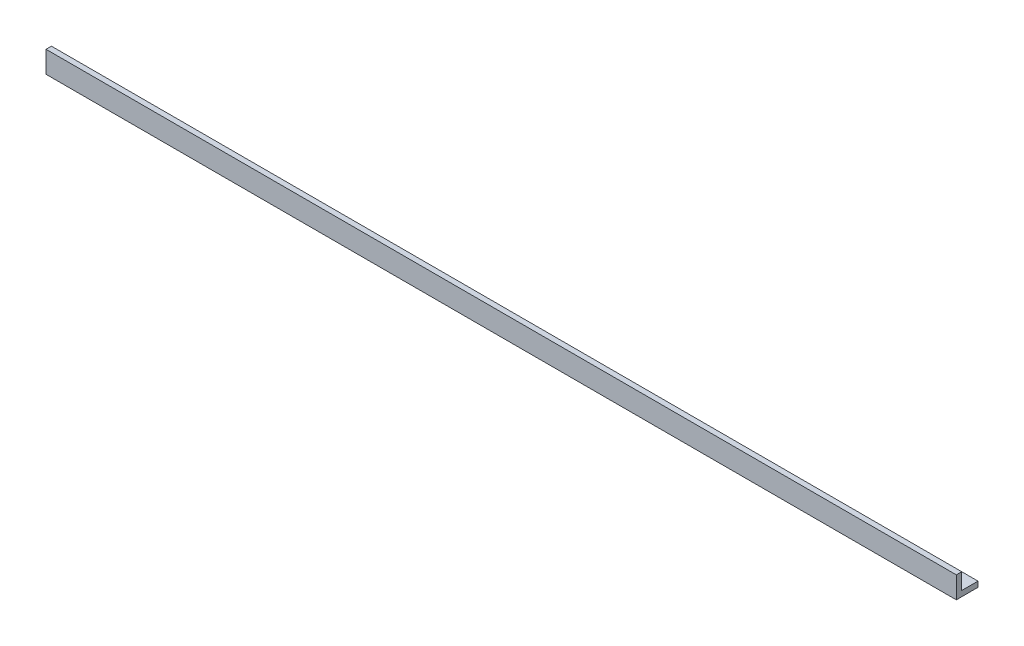
ISO-10303-21;
HEADER;
FILE_DESCRIPTION(('STEP AP214'),'2;1');
FILE_NAME('part.step','',(''),(''),'','','');
FILE_SCHEMA(('AUTOMOTIVE_DESIGN { 1 0 10303 214 1 1 1 1 }'));
ENDSEC;
DATA;
#1=APPLICATION_CONTEXT('core data for automotive mechanical design processes');
#2=APPLICATION_PROTOCOL_DEFINITION('international standard','automotive_design',2000,#1);
#3=PRODUCT_CONTEXT('',#1,'mechanical');
#4=PRODUCT('Part','Part','',(#3));
#5=PRODUCT_RELATED_PRODUCT_CATEGORY('part','',(#4));
#6=PRODUCT_DEFINITION_FORMATION('','',#4);
#7=PRODUCT_DEFINITION_CONTEXT('part definition',#1,'design');
#8=PRODUCT_DEFINITION('design','',#6,#7);
#9=PRODUCT_DEFINITION_SHAPE('','',#8);
#10=(LENGTH_UNIT() NAMED_UNIT(*) SI_UNIT(.MILLI.,.METRE.));
#11=(NAMED_UNIT(*) PLANE_ANGLE_UNIT() SI_UNIT($,.RADIAN.));
#12=(NAMED_UNIT(*) SI_UNIT($,.STERADIAN.) SOLID_ANGLE_UNIT());
#13=UNCERTAINTY_MEASURE_WITH_UNIT(LENGTH_MEASURE(1.E-05),#10,'distance_accuracy_value','');
#14=(GEOMETRIC_REPRESENTATION_CONTEXT(3) GLOBAL_UNCERTAINTY_ASSIGNED_CONTEXT((#13)) GLOBAL_UNIT_ASSIGNED_CONTEXT((#10,
#11,#12)) REPRESENTATION_CONTEXT('',''));
#15=CARTESIAN_POINT('',(0.,0.,0.));
#16=DIRECTION('',(0.,0.,1.));
#17=DIRECTION('',(1.,0.,0.));
#18=AXIS2_PLACEMENT_3D('',#15,#16,#17);
#19=CARTESIAN_POINT('',(-533.4,0.,-25.4));
#20=DIRECTION('',(0.,0.,1.));
#21=DIRECTION('',(1.,0.,0.));
#22=AXIS2_PLACEMENT_3D('',#19,#20,#21);
#23=PLANE('',#22);
#24=DIRECTION('',(1.,0.,0.));
#25=VECTOR('',#24,1.);
#26=CARTESIAN_POINT('',(-533.4,6.35,-25.4));
#27=LINE('',#26,#25);
#28=CARTESIAN_POINT('',(-533.4,6.35,-25.4));
#29=VERTEX_POINT('',#28);
#30=CARTESIAN_POINT('',(533.4,6.35,-25.4));
#31=VERTEX_POINT('',#30);
#32=EDGE_CURVE('E39',#29,#31,#27,.T.);
#33=ORIENTED_EDGE('',*,*,#32,.T.);
#34=DIRECTION('',(0.,-1.,0.));
#35=VECTOR('',#34,1.);
#36=CARTESIAN_POINT('',(533.4,0.,-25.4));
#37=LINE('',#36,#35);
#38=CARTESIAN_POINT('',(533.4,0.,-25.4));
#39=VERTEX_POINT('',#38);
#40=EDGE_CURVE('E91',#31,#39,#37,.T.);
#41=ORIENTED_EDGE('',*,*,#40,.T.);
#42=DIRECTION('',(1.,0.,0.));
#43=VECTOR('',#42,1.);
#44=CARTESIAN_POINT('',(-533.4,0.,-25.4));
#45=LINE('',#44,#43);
#46=CARTESIAN_POINT('',(-533.4,0.,-25.4));
#47=VERTEX_POINT('',#46);
#48=EDGE_CURVE('E11',#47,#39,#45,.T.);
#49=ORIENTED_EDGE('',*,*,#48,.F.);
#50=DIRECTION('',(0.,-1.,0.));
#51=VECTOR('',#50,1.);
#52=CARTESIAN_POINT('',(-533.4,0.,-25.4));
#53=LINE('',#52,#51);
#54=EDGE_CURVE('E52',#29,#47,#53,.T.);
#55=ORIENTED_EDGE('',*,*,#54,.F.);
#56=EDGE_LOOP('',(#33,#41,#49,#55));
#57=FACE_BOUND('',#56,.T.);
#58=ADVANCED_FACE('F36',(#57),#23,.F.);
#59=CARTESIAN_POINT('',(-533.4,0.,0.));
#60=DIRECTION('',(0.,-1.,0.));
#61=DIRECTION('',(0.,0.,-1.));
#62=AXIS2_PLACEMENT_3D('',#59,#60,#61);
#63=PLANE('',#62);
#64=ORIENTED_EDGE('',*,*,#48,.T.);
#65=DIRECTION('',(0.,0.,-1.));
#66=VECTOR('',#65,1.);
#67=CARTESIAN_POINT('',(533.4,0.,0.));
#68=LINE('',#67,#66);
#69=CARTESIAN_POINT('',(533.4,0.,0.));
#70=VERTEX_POINT('',#69);
#71=EDGE_CURVE('E105',#70,#39,#68,.T.);
#72=ORIENTED_EDGE('',*,*,#71,.F.);
#73=DIRECTION('',(1.,0.,0.));
#74=VECTOR('',#73,1.);
#75=CARTESIAN_POINT('',(-533.4,0.,0.));
#76=LINE('',#75,#74);
#77=CARTESIAN_POINT('',(-533.4,0.,0.));
#78=VERTEX_POINT('',#77);
#79=EDGE_CURVE('E44',#78,#70,#76,.T.);
#80=ORIENTED_EDGE('',*,*,#79,.F.);
#81=DIRECTION('',(0.,0.,-1.));
#82=VECTOR('',#81,1.);
#83=CARTESIAN_POINT('',(-533.4,0.,0.));
#84=LINE('',#83,#82);
#85=EDGE_CURVE('E96',#78,#47,#84,.T.);
#86=ORIENTED_EDGE('',*,*,#85,.T.);
#87=EDGE_LOOP('',(#64,#72,#80,#86));
#88=FACE_BOUND('',#87,.T.);
#89=ADVANCED_FACE('F145',(#88),#63,.T.);
#90=CARTESIAN_POINT('',(-533.4,0.,0.));
#91=DIRECTION('',(0.,0.,1.));
#92=DIRECTION('',(1.,0.,0.));
#93=AXIS2_PLACEMENT_3D('',#90,#91,#92);
#94=PLANE('',#93);
#95=ORIENTED_EDGE('',*,*,#79,.T.);
#96=DIRECTION('',(0.,-1.,0.));
#97=VECTOR('',#96,1.);
#98=CARTESIAN_POINT('',(533.4,0.,0.));
#99=LINE('',#98,#97);
#100=CARTESIAN_POINT('',(533.4,25.4,0.));
#101=VERTEX_POINT('',#100);
#102=EDGE_CURVE('E116',#101,#70,#99,.T.);
#103=ORIENTED_EDGE('',*,*,#102,.F.);
#104=DIRECTION('',(1.,0.,0.));
#105=VECTOR('',#104,1.);
#106=CARTESIAN_POINT('',(-533.4,25.4,0.));
#107=LINE('',#106,#105);
#108=CARTESIAN_POINT('',(-533.4,25.4,0.));
#109=VERTEX_POINT('',#108);
#110=EDGE_CURVE('E130',#109,#101,#107,.T.);
#111=ORIENTED_EDGE('',*,*,#110,.F.);
#112=DIRECTION('',(0.,-1.,0.));
#113=VECTOR('',#112,1.);
#114=CARTESIAN_POINT('',(-533.4,0.,0.));
#115=LINE('',#114,#113);
#116=EDGE_CURVE('E126',#109,#78,#115,.T.);
#117=ORIENTED_EDGE('',*,*,#116,.T.);
#118=EDGE_LOOP('',(#95,#103,#111,#117));
#119=FACE_BOUND('',#118,.T.);
#120=ADVANCED_FACE('F144',(#119),#94,.T.);
#121=CARTESIAN_POINT('',(-533.4,25.4,0.));
#122=DIRECTION('',(0.,-1.,0.));
#123=DIRECTION('',(0.,0.,-1.));
#124=AXIS2_PLACEMENT_3D('',#121,#122,#123);
#125=PLANE('',#124);
#126=ORIENTED_EDGE('',*,*,#110,.T.);
#127=DIRECTION('',(0.,0.,-1.));
#128=VECTOR('',#127,1.);
#129=CARTESIAN_POINT('',(533.4,25.4,0.));
#130=LINE('',#129,#128);
#131=CARTESIAN_POINT('',(533.4,25.4,-6.35));
#132=VERTEX_POINT('',#131);
#133=EDGE_CURVE('E111',#101,#132,#130,.T.);
#134=ORIENTED_EDGE('',*,*,#133,.T.);
#135=DIRECTION('',(1.,0.,0.));
#136=VECTOR('',#135,1.);
#137=CARTESIAN_POINT('',(-533.4,25.4,-6.35));
#138=LINE('',#137,#136);
#139=CARTESIAN_POINT('',(-533.4,25.4,-6.35));
#140=VERTEX_POINT('',#139);
#141=EDGE_CURVE('E132',#140,#132,#138,.T.);
#142=ORIENTED_EDGE('',*,*,#141,.F.);
#143=DIRECTION('',(0.,0.,-1.));
#144=VECTOR('',#143,1.);
#145=CARTESIAN_POINT('',(-533.4,25.4,0.));
#146=LINE('',#145,#144);
#147=EDGE_CURVE('E124',#109,#140,#146,.T.);
#148=ORIENTED_EDGE('',*,*,#147,.F.);
#149=EDGE_LOOP('',(#126,#134,#142,#148));
#150=FACE_BOUND('',#149,.T.);
#151=ADVANCED_FACE('F140',(#150),#125,.F.);
#152=CARTESIAN_POINT('',(-533.4,0.,-6.35));
#153=DIRECTION('',(0.,0.,1.));
#154=DIRECTION('',(1.,0.,0.));
#155=AXIS2_PLACEMENT_3D('',#152,#153,#154);
#156=PLANE('',#155);
#157=ORIENTED_EDGE('',*,*,#141,.T.);
#158=DIRECTION('',(0.,-1.,0.));
#159=VECTOR('',#158,1.);
#160=CARTESIAN_POINT('',(533.4,0.,-6.35));
#161=LINE('',#160,#159);
#162=CARTESIAN_POINT('',(533.4,6.35,-6.35));
#163=VERTEX_POINT('',#162);
#164=EDGE_CURVE('E109',#132,#163,#161,.T.);
#165=ORIENTED_EDGE('',*,*,#164,.T.);
#166=DIRECTION('',(1.,0.,0.));
#167=VECTOR('',#166,1.);
#168=CARTESIAN_POINT('',(-533.4,6.35,-6.35));
#169=LINE('',#168,#167);
#170=CARTESIAN_POINT('',(-533.4,6.35,-6.35));
#171=VERTEX_POINT('',#170);
#172=EDGE_CURVE('E95',#171,#163,#169,.T.);
#173=ORIENTED_EDGE('',*,*,#172,.F.);
#174=DIRECTION('',(0.,-1.,0.));
#175=VECTOR('',#174,1.);
#176=CARTESIAN_POINT('',(-533.4,0.,-6.35));
#177=LINE('',#176,#175);
#178=EDGE_CURVE('E122',#140,#171,#177,.T.);
#179=ORIENTED_EDGE('',*,*,#178,.F.);
#180=EDGE_LOOP('',(#157,#165,#173,#179));
#181=FACE_BOUND('',#180,.T.);
#182=ADVANCED_FACE('F136',(#181),#156,.F.);
#183=CARTESIAN_POINT('',(-533.4,6.35,0.));
#184=DIRECTION('',(0.,-1.,0.));
#185=DIRECTION('',(0.,0.,-1.));
#186=AXIS2_PLACEMENT_3D('',#183,#184,#185);
#187=PLANE('',#186);
#188=ORIENTED_EDGE('',*,*,#172,.T.);
#189=DIRECTION('',(0.,0.,-1.));
#190=VECTOR('',#189,1.);
#191=CARTESIAN_POINT('',(533.4,6.35,0.));
#192=LINE('',#191,#190);
#193=EDGE_CURVE('E102',#163,#31,#192,.T.);
#194=ORIENTED_EDGE('',*,*,#193,.T.);
#195=ORIENTED_EDGE('',*,*,#32,.F.);
#196=DIRECTION('',(0.,0.,-1.));
#197=VECTOR('',#196,1.);
#198=CARTESIAN_POINT('',(-533.4,6.35,0.));
#199=LINE('',#198,#197);
#200=EDGE_CURVE('E120',#171,#29,#199,.T.);
#201=ORIENTED_EDGE('',*,*,#200,.F.);
#202=EDGE_LOOP('',(#188,#194,#195,#201));
#203=FACE_BOUND('',#202,.T.);
#204=ADVANCED_FACE('F107',(#203),#187,.F.);
#205=CARTESIAN_POINT('',(-533.4,0.,0.));
#206=DIRECTION('',(1.,0.,0.));
#207=DIRECTION('',(0.,0.,-1.));
#208=AXIS2_PLACEMENT_3D('',#205,#206,#207);
#209=PLANE('',#208);
#210=ORIENTED_EDGE('',*,*,#54,.T.);
#211=ORIENTED_EDGE('',*,*,#85,.F.);
#212=ORIENTED_EDGE('',*,*,#116,.F.);
#213=ORIENTED_EDGE('',*,*,#147,.T.);
#214=ORIENTED_EDGE('',*,*,#178,.T.);
#215=ORIENTED_EDGE('',*,*,#200,.T.);
#216=EDGE_LOOP('',(#210,#211,#212,#213,#214,#215));
#217=FACE_BOUND('',#216,.T.);
#218=ADVANCED_FACE('F146',(#217),#209,.F.);
#219=CARTESIAN_POINT('',(533.4,0.,0.));
#220=DIRECTION('',(1.,0.,0.));
#221=DIRECTION('',(0.,0.,-1.));
#222=AXIS2_PLACEMENT_3D('',#219,#220,#221);
#223=PLANE('',#222);
#224=ORIENTED_EDGE('',*,*,#40,.F.);
#225=ORIENTED_EDGE('',*,*,#193,.F.);
#226=ORIENTED_EDGE('',*,*,#164,.F.);
#227=ORIENTED_EDGE('',*,*,#133,.F.);
#228=ORIENTED_EDGE('',*,*,#102,.T.);
#229=ORIENTED_EDGE('',*,*,#71,.T.);
#230=EDGE_LOOP('',(#224,#225,#226,#227,#228,#229));
#231=FACE_BOUND('',#230,.T.);
#232=ADVANCED_FACE('F100',(#231),#223,.T.);
#233=CLOSED_SHELL('',(#58,#89,#120,#151,#182,#204,#218,#232));
#234=MANIFOLD_SOLID_BREP('B2',#233);
#235=ADVANCED_BREP_SHAPE_REPRESENTATION('',(#18,#234),#14);
#236=SHAPE_DEFINITION_REPRESENTATION(#9,#235);
ENDSEC;
END-ISO-10303-21;
